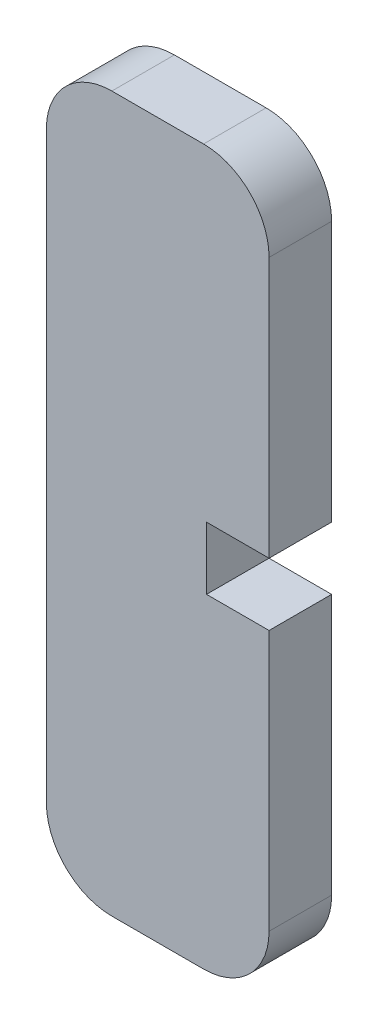
ISO-10303-21;
HEADER;
FILE_DESCRIPTION(('STEP AP214'),'2;1');
FILE_NAME('part.step','',(''),(''),'','','');
FILE_SCHEMA(('AUTOMOTIVE_DESIGN { 1 0 10303 214 1 1 1 1 }'));
ENDSEC;
DATA;
#1=APPLICATION_CONTEXT('core data for automotive mechanical design processes');
#2=APPLICATION_PROTOCOL_DEFINITION('international standard','automotive_design',2000,#1);
#3=PRODUCT_CONTEXT('',#1,'mechanical');
#4=PRODUCT('Part','Part','',(#3));
#5=PRODUCT_RELATED_PRODUCT_CATEGORY('part','',(#4));
#6=PRODUCT_DEFINITION_FORMATION('','',#4);
#7=PRODUCT_DEFINITION_CONTEXT('part definition',#1,'design');
#8=PRODUCT_DEFINITION('design','',#6,#7);
#9=PRODUCT_DEFINITION_SHAPE('','',#8);
#10=(LENGTH_UNIT() NAMED_UNIT(*) SI_UNIT(.MILLI.,.METRE.));
#11=(NAMED_UNIT(*) PLANE_ANGLE_UNIT() SI_UNIT($,.RADIAN.));
#12=(NAMED_UNIT(*) SI_UNIT($,.STERADIAN.) SOLID_ANGLE_UNIT());
#13=UNCERTAINTY_MEASURE_WITH_UNIT(LENGTH_MEASURE(1.E-05),#10,'distance_accuracy_value','');
#14=(GEOMETRIC_REPRESENTATION_CONTEXT(3) GLOBAL_UNCERTAINTY_ASSIGNED_CONTEXT((#13)) GLOBAL_UNIT_ASSIGNED_CONTEXT((#10,
#11,#12)) REPRESENTATION_CONTEXT('',''));
#15=CARTESIAN_POINT('',(0.,0.,0.));
#16=DIRECTION('',(0.,0.,1.));
#17=DIRECTION('',(1.,0.,0.));
#18=AXIS2_PLACEMENT_3D('',#15,#16,#17);
#19=CARTESIAN_POINT('',(12.4496000000003,44.7751999999999,4.7752));
#20=DIRECTION('',(-1.,0.,0.));
#21=DIRECTION('',(0.,-1.,0.));
#22=AXIS2_PLACEMENT_3D('',#19,#20,#21);
#23=PLANE('',#22);
#24=DIRECTION('',(0.,1.,0.));
#25=VECTOR('',#24,1.);
#26=CARTESIAN_POINT('',(12.4496000000003,44.7751999999999,0.));
#27=LINE('',#26,#25);
#28=CARTESIAN_POINT('',(12.4496000000001,0.224799999999933,0.));
#29=VERTEX_POINT('',#28);
#30=CARTESIAN_POINT('',(12.4496000000002,20.1123999999999,0.));
#31=VERTEX_POINT('',#30);
#32=EDGE_CURVE('E182',#29,#31,#27,.T.);
#33=ORIENTED_EDGE('',*,*,#32,.T.);
#34=DIRECTION('',(0.,0.,-1.));
#35=VECTOR('',#34,1.);
#36=CARTESIAN_POINT('',(12.4496000000002,20.1123999999999,4.7752));
#37=LINE('',#36,#35);
#38=CARTESIAN_POINT('',(12.4496000000002,20.1123999999999,4.7752));
#39=VERTEX_POINT('',#38);
#40=EDGE_CURVE('E170',#39,#31,#37,.T.);
#41=ORIENTED_EDGE('',*,*,#40,.F.);
#42=DIRECTION('',(0.,1.,0.));
#43=VECTOR('',#42,1.);
#44=CARTESIAN_POINT('',(12.4496000000003,44.7751999999999,4.7752));
#45=LINE('',#44,#43);
#46=CARTESIAN_POINT('',(12.4496000000001,0.224799999999933,4.7752));
#47=VERTEX_POINT('',#46);
#48=EDGE_CURVE('E142',#47,#39,#45,.T.);
#49=ORIENTED_EDGE('',*,*,#48,.F.);
#50=DIRECTION('',(0.,0.,-1.));
#51=VECTOR('',#50,1.);
#52=CARTESIAN_POINT('',(12.4496000000001,0.224799999999933,4.7752));
#53=LINE('',#52,#51);
#54=EDGE_CURVE('E153',#47,#29,#53,.T.);
#55=ORIENTED_EDGE('',*,*,#54,.T.);
#56=EDGE_LOOP('',(#33,#41,#49,#55));
#57=FACE_BOUND('',#56,.T.);
#58=ADVANCED_FACE('F45',(#57),#23,.F.);
#59=CARTESIAN_POINT('',(0.449600000000273,44.7751999999999,4.7752));
#60=DIRECTION('',(0.,0.,-1.));
#61=DIRECTION('',(-1.,0.,0.));
#62=AXIS2_PLACEMENT_3D('',#59,#60,#61);
#63=CYLINDRICAL_SURFACE('',#62,5.);
#64=CARTESIAN_POINT('',(0.449600000000273,44.7751999999999,0.));
#65=DIRECTION('',(0.,0.,1.));
#66=DIRECTION('',(-1.,0.,0.));
#67=AXIS2_PLACEMENT_3D('',#64,#65,#66);
#68=CIRCLE('',#67,5.);
#69=CARTESIAN_POINT('',(0.449600000000274,49.7751999999999,0.));
#70=VERTEX_POINT('',#69);
#71=CARTESIAN_POINT('',(-4.55039999999973,44.7752,0.));
#72=VERTEX_POINT('',#71);
#73=EDGE_CURVE('E165',#70,#72,#68,.T.);
#74=ORIENTED_EDGE('',*,*,#73,.T.);
#75=DIRECTION('',(0.,0.,-1.));
#76=VECTOR('',#75,1.);
#77=CARTESIAN_POINT('',(-4.55039999999973,44.7752,4.7752));
#78=LINE('',#77,#76);
#79=CARTESIAN_POINT('',(-4.55039999999973,44.7752,4.7752));
#80=VERTEX_POINT('',#79);
#81=EDGE_CURVE('E11',#80,#72,#78,.T.);
#82=ORIENTED_EDGE('',*,*,#81,.F.);
#83=CARTESIAN_POINT('',(0.449600000000273,44.7751999999999,4.7752));
#84=DIRECTION('',(0.,0.,1.));
#85=DIRECTION('',(-1.,0.,0.));
#86=AXIS2_PLACEMENT_3D('',#83,#84,#85);
#87=CIRCLE('',#86,5.);
#88=CARTESIAN_POINT('',(0.449600000000274,49.7751999999999,4.7752));
#89=VERTEX_POINT('',#88);
#90=EDGE_CURVE('E191',#89,#80,#87,.T.);
#91=ORIENTED_EDGE('',*,*,#90,.F.);
#92=DIRECTION('',(0.,0.,-1.));
#93=VECTOR('',#92,1.);
#94=CARTESIAN_POINT('',(0.449600000000274,49.7751999999999,4.7752));
#95=LINE('',#94,#93);
#96=EDGE_CURVE('E161',#89,#70,#95,.T.);
#97=ORIENTED_EDGE('',*,*,#96,.T.);
#98=EDGE_LOOP('',(#74,#82,#91,#97));
#99=FACE_BOUND('',#98,.T.);
#100=ADVANCED_FACE('F47',(#99),#63,.T.);
#101=CARTESIAN_POINT('',(-4.55039999999973,44.7752,4.7752));
#102=DIRECTION('',(1.,0.,0.));
#103=DIRECTION('',(0.,1.,0.));
#104=AXIS2_PLACEMENT_3D('',#101,#102,#103);
#105=PLANE('',#104);
#106=DIRECTION('',(0.,-1.,0.));
#107=VECTOR('',#106,1.);
#108=CARTESIAN_POINT('',(-4.55039999999973,44.7752,0.));
#109=LINE('',#108,#107);
#110=CARTESIAN_POINT('',(-4.55039999999988,0.224799999999953,0.));
#111=VERTEX_POINT('',#110);
#112=EDGE_CURVE('E169',#72,#111,#109,.T.);
#113=ORIENTED_EDGE('',*,*,#112,.T.);
#114=DIRECTION('',(0.,0.,-1.));
#115=VECTOR('',#114,1.);
#116=CARTESIAN_POINT('',(-4.55039999999988,0.224799999999953,4.7752));
#117=LINE('',#116,#115);
#118=CARTESIAN_POINT('',(-4.55039999999988,0.224799999999953,4.7752));
#119=VERTEX_POINT('',#118);
#120=EDGE_CURVE('E54',#119,#111,#117,.T.);
#121=ORIENTED_EDGE('',*,*,#120,.F.);
#122=DIRECTION('',(0.,-1.,0.));
#123=VECTOR('',#122,1.);
#124=CARTESIAN_POINT('',(-4.55039999999973,44.7752,4.7752));
#125=LINE('',#124,#123);
#126=EDGE_CURVE('E111',#80,#119,#125,.T.);
#127=ORIENTED_EDGE('',*,*,#126,.F.);
#128=ORIENTED_EDGE('',*,*,#81,.T.);
#129=EDGE_LOOP('',(#113,#121,#127,#128));
#130=FACE_BOUND('',#129,.T.);
#131=ADVANCED_FACE('F297',(#130),#105,.F.);
#132=CARTESIAN_POINT('',(0.449600000000116,0.224799999999933,4.7752));
#133=DIRECTION('',(0.,0.,-1.));
#134=DIRECTION('',(-1.,0.,0.));
#135=AXIS2_PLACEMENT_3D('',#132,#133,#134);
#136=CYLINDRICAL_SURFACE('',#135,5.);
#137=CARTESIAN_POINT('',(0.449600000000116,0.224799999999933,0.));
#138=DIRECTION('',(0.,0.,1.));
#139=DIRECTION('',(1.,0.,0.));
#140=AXIS2_PLACEMENT_3D('',#137,#138,#139);
#141=CIRCLE('',#140,5.);
#142=CARTESIAN_POINT('',(0.449600000000115,-4.77520000000007,0.));
#143=VERTEX_POINT('',#142);
#144=EDGE_CURVE('E173',#111,#143,#141,.T.);
#145=ORIENTED_EDGE('',*,*,#144,.T.);
#146=DIRECTION('',(0.,0.,-1.));
#147=VECTOR('',#146,1.);
#148=CARTESIAN_POINT('',(0.449600000000115,-4.77520000000007,4.7752));
#149=LINE('',#148,#147);
#150=CARTESIAN_POINT('',(0.449600000000115,-4.77520000000007,4.7752));
#151=VERTEX_POINT('',#150);
#152=EDGE_CURVE('E203',#151,#143,#149,.T.);
#153=ORIENTED_EDGE('',*,*,#152,.F.);
#154=CARTESIAN_POINT('',(0.449600000000116,0.224799999999933,4.7752));
#155=DIRECTION('',(0.,0.,1.));
#156=DIRECTION('',(1.,0.,0.));
#157=AXIS2_PLACEMENT_3D('',#154,#155,#156);
#158=CIRCLE('',#157,5.);
#159=EDGE_CURVE('E213',#119,#151,#158,.T.);
#160=ORIENTED_EDGE('',*,*,#159,.F.);
#161=ORIENTED_EDGE('',*,*,#120,.T.);
#162=EDGE_LOOP('',(#145,#153,#160,#161));
#163=FACE_BOUND('',#162,.T.);
#164=ADVANCED_FACE('F211',(#163),#136,.T.);
#165=CARTESIAN_POINT('',(0.449600000000116,-4.77520000000007,4.7752));
#166=DIRECTION('',(0.,1.,0.));
#167=DIRECTION('',(0.,0.,1.));
#168=AXIS2_PLACEMENT_3D('',#165,#166,#167);
#169=PLANE('',#168);
#170=DIRECTION('',(1.,0.,0.));
#171=VECTOR('',#170,1.);
#172=CARTESIAN_POINT('',(0.449600000000116,-4.77520000000007,0.));
#173=LINE('',#172,#171);
#174=CARTESIAN_POINT('',(7.44960000000012,-4.77520000000007,0.));
#175=VERTEX_POINT('',#174);
#176=EDGE_CURVE('E176',#143,#175,#173,.T.);
#177=ORIENTED_EDGE('',*,*,#176,.T.);
#178=DIRECTION('',(0.,0.,-1.));
#179=VECTOR('',#178,1.);
#180=CARTESIAN_POINT('',(7.44960000000012,-4.77520000000007,4.7752));
#181=LINE('',#180,#179);
#182=CARTESIAN_POINT('',(7.44960000000012,-4.77520000000007,4.7752));
#183=VERTEX_POINT('',#182);
#184=EDGE_CURVE('E199',#183,#175,#181,.T.);
#185=ORIENTED_EDGE('',*,*,#184,.F.);
#186=DIRECTION('',(1.,0.,0.));
#187=VECTOR('',#186,1.);
#188=CARTESIAN_POINT('',(0.449600000000116,-4.77520000000007,4.7752));
#189=LINE('',#188,#187);
#190=EDGE_CURVE('E230',#151,#183,#189,.T.);
#191=ORIENTED_EDGE('',*,*,#190,.F.);
#192=ORIENTED_EDGE('',*,*,#152,.T.);
#193=EDGE_LOOP('',(#177,#185,#191,#192));
#194=FACE_BOUND('',#193,.T.);
#195=ADVANCED_FACE('F222',(#194),#169,.F.);
#196=CARTESIAN_POINT('',(7.44960000000012,0.224799999999933,4.7752));
#197=DIRECTION('',(0.,0.,-1.));
#198=DIRECTION('',(-1.,0.,0.));
#199=AXIS2_PLACEMENT_3D('',#196,#197,#198);
#200=CYLINDRICAL_SURFACE('',#199,5.);
#201=CARTESIAN_POINT('',(7.44960000000012,0.224799999999933,0.));
#202=DIRECTION('',(0.,0.,1.));
#203=DIRECTION('',(1.,0.,0.));
#204=AXIS2_PLACEMENT_3D('',#201,#202,#203);
#205=CIRCLE('',#204,5.);
#206=EDGE_CURVE('E179',#175,#29,#205,.T.);
#207=ORIENTED_EDGE('',*,*,#206,.T.);
#208=ORIENTED_EDGE('',*,*,#54,.F.);
#209=CARTESIAN_POINT('',(7.44960000000012,0.224799999999933,4.7752));
#210=DIRECTION('',(0.,0.,1.));
#211=DIRECTION('',(1.,0.,0.));
#212=AXIS2_PLACEMENT_3D('',#209,#210,#211);
#213=CIRCLE('',#212,5.);
#214=EDGE_CURVE('E143',#183,#47,#213,.T.);
#215=ORIENTED_EDGE('',*,*,#214,.F.);
#216=ORIENTED_EDGE('',*,*,#184,.T.);
#217=EDGE_LOOP('',(#207,#208,#215,#216));
#218=FACE_BOUND('',#217,.T.);
#219=ADVANCED_FACE('F226',(#218),#200,.T.);
#220=CARTESIAN_POINT('',(12.4496000000002,24.8875999999999,4.7752));
#221=VERTEX_POINT('',#220);
#222=CARTESIAN_POINT('',(12.4496000000003,44.7751999999999,4.7752));
#223=VERTEX_POINT('',#222);
#224=EDGE_CURVE('E128',#221,#223,#45,.T.);
#225=ORIENTED_EDGE('',*,*,#224,.F.);
#226=DIRECTION('',(0.,0.,-1.));
#227=VECTOR('',#226,1.);
#228=CARTESIAN_POINT('',(12.4496000000002,24.8875999999999,4.7752));
#229=LINE('',#228,#227);
#230=CARTESIAN_POINT('',(12.4496000000002,24.8875999999999,0.));
#231=VERTEX_POINT('',#230);
#232=EDGE_CURVE('E247',#221,#231,#229,.T.);
#233=ORIENTED_EDGE('',*,*,#232,.T.);
#234=CARTESIAN_POINT('',(12.4496000000003,44.7751999999999,0.));
#235=VERTEX_POINT('',#234);
#236=EDGE_CURVE('E149',#231,#235,#27,.T.);
#237=ORIENTED_EDGE('',*,*,#236,.T.);
#238=DIRECTION('',(0.,0.,-1.));
#239=VECTOR('',#238,1.);
#240=CARTESIAN_POINT('',(12.4496000000003,44.7751999999999,4.7752));
#241=LINE('',#240,#239);
#242=EDGE_CURVE('E146',#223,#235,#241,.T.);
#243=ORIENTED_EDGE('',*,*,#242,.F.);
#244=EDGE_LOOP('',(#225,#233,#237,#243));
#245=FACE_BOUND('',#244,.T.);
#246=ADVANCED_FACE('F147',(#245),#23,.F.);
#247=CARTESIAN_POINT('',(7.44960000000027,44.7751999999999,4.7752));
#248=DIRECTION('',(0.,0.,-1.));
#249=DIRECTION('',(-1.,0.,0.));
#250=AXIS2_PLACEMENT_3D('',#247,#248,#249);
#251=CYLINDRICAL_SURFACE('',#250,5.);
#252=CARTESIAN_POINT('',(7.44960000000027,44.7751999999999,0.));
#253=DIRECTION('',(0.,0.,1.));
#254=DIRECTION('',(-1.,0.,0.));
#255=AXIS2_PLACEMENT_3D('',#252,#253,#254);
#256=CIRCLE('',#255,5.);
#257=CARTESIAN_POINT('',(7.44960000000028,49.7751999999999,0.));
#258=VERTEX_POINT('',#257);
#259=EDGE_CURVE('E186',#235,#258,#256,.T.);
#260=ORIENTED_EDGE('',*,*,#259,.T.);
#261=DIRECTION('',(0.,0.,-1.));
#262=VECTOR('',#261,1.);
#263=CARTESIAN_POINT('',(7.44960000000028,49.7751999999999,4.7752));
#264=LINE('',#263,#262);
#265=CARTESIAN_POINT('',(7.44960000000028,49.7751999999999,4.7752));
#266=VERTEX_POINT('',#265);
#267=EDGE_CURVE('E154',#266,#258,#264,.T.);
#268=ORIENTED_EDGE('',*,*,#267,.F.);
#269=CARTESIAN_POINT('',(7.44960000000027,44.7751999999999,4.7752));
#270=DIRECTION('',(0.,0.,1.));
#271=DIRECTION('',(-1.,0.,0.));
#272=AXIS2_PLACEMENT_3D('',#269,#270,#271);
#273=CIRCLE('',#272,5.);
#274=EDGE_CURVE('E133',#223,#266,#273,.T.);
#275=ORIENTED_EDGE('',*,*,#274,.F.);
#276=ORIENTED_EDGE('',*,*,#242,.T.);
#277=EDGE_LOOP('',(#260,#268,#275,#276));
#278=FACE_BOUND('',#277,.T.);
#279=ADVANCED_FACE('F156',(#278),#251,.T.);
#280=CARTESIAN_POINT('',(0.449600000000274,49.7751999999999,4.7752));
#281=DIRECTION('',(0.,-1.,0.));
#282=DIRECTION('',(0.,0.,-1.));
#283=AXIS2_PLACEMENT_3D('',#280,#281,#282);
#284=PLANE('',#283);
#285=DIRECTION('',(-1.,0.,0.));
#286=VECTOR('',#285,1.);
#287=CARTESIAN_POINT('',(0.449600000000274,49.7751999999999,0.));
#288=LINE('',#287,#286);
#289=EDGE_CURVE('E103',#258,#70,#288,.T.);
#290=ORIENTED_EDGE('',*,*,#289,.T.);
#291=ORIENTED_EDGE('',*,*,#96,.F.);
#292=DIRECTION('',(-1.,0.,0.));
#293=VECTOR('',#292,1.);
#294=CARTESIAN_POINT('',(0.449600000000274,49.7751999999999,4.7752));
#295=LINE('',#294,#293);
#296=EDGE_CURVE('E70',#266,#89,#295,.T.);
#297=ORIENTED_EDGE('',*,*,#296,.F.);
#298=ORIENTED_EDGE('',*,*,#267,.T.);
#299=EDGE_LOOP('',(#290,#291,#297,#298));
#300=FACE_BOUND('',#299,.T.);
#301=ADVANCED_FACE('F293',(#300),#284,.F.);
#302=CARTESIAN_POINT('',(0.449600000000273,44.7751999999999,4.7752));
#303=DIRECTION('',(0.,0.,-1.));
#304=DIRECTION('',(-1.,0.,0.));
#305=AXIS2_PLACEMENT_3D('',#302,#303,#304);
#306=PLANE('',#305);
#307=ORIENTED_EDGE('',*,*,#48,.T.);
#308=DIRECTION('',(-1.,0.,0.));
#309=VECTOR('',#308,1.);
#310=CARTESIAN_POINT('',(7.67440000000012,20.1123999999999,4.7752));
#311=LINE('',#310,#309);
#312=CARTESIAN_POINT('',(7.67440000000012,20.1123999999999,4.7752));
#313=VERTEX_POINT('',#312);
#314=EDGE_CURVE('E256',#39,#313,#311,.T.);
#315=ORIENTED_EDGE('',*,*,#314,.T.);
#316=DIRECTION('',(0.,1.,0.));
#317=VECTOR('',#316,1.);
#318=CARTESIAN_POINT('',(7.67440000000012,20.1123999999999,4.7752));
#319=LINE('',#318,#317);
#320=CARTESIAN_POINT('',(7.67440000000012,24.8875999999999,4.7752));
#321=VERTEX_POINT('',#320);
#322=EDGE_CURVE('E265',#313,#321,#319,.T.);
#323=ORIENTED_EDGE('',*,*,#322,.T.);
#324=DIRECTION('',(1.,0.,0.));
#325=VECTOR('',#324,1.);
#326=CARTESIAN_POINT('',(7.67440000000012,24.8875999999999,4.7752));
#327=LINE('',#326,#325);
#328=EDGE_CURVE('E138',#321,#221,#327,.T.);
#329=ORIENTED_EDGE('',*,*,#328,.T.);
#330=ORIENTED_EDGE('',*,*,#224,.T.);
#331=ORIENTED_EDGE('',*,*,#274,.T.);
#332=ORIENTED_EDGE('',*,*,#296,.T.);
#333=ORIENTED_EDGE('',*,*,#90,.T.);
#334=ORIENTED_EDGE('',*,*,#126,.T.);
#335=ORIENTED_EDGE('',*,*,#159,.T.);
#336=ORIENTED_EDGE('',*,*,#190,.T.);
#337=ORIENTED_EDGE('',*,*,#214,.T.);
#338=EDGE_LOOP('',(#307,#315,#323,#329,#330,#331,#332,#333,#334,#335,#336,#337));
#339=FACE_BOUND('',#338,.T.);
#340=ADVANCED_FACE('F131',(#339),#306,.F.);
#341=CARTESIAN_POINT('',(0.449600000000273,44.7751999999999,0.));
#342=DIRECTION('',(0.,0.,-1.));
#343=DIRECTION('',(-1.,0.,0.));
#344=AXIS2_PLACEMENT_3D('',#341,#342,#343);
#345=PLANE('',#344);
#346=DIRECTION('',(-1.,0.,0.));
#347=VECTOR('',#346,1.);
#348=CARTESIAN_POINT('',(7.67440000000012,20.1123999999999,0.));
#349=LINE('',#348,#347);
#350=CARTESIAN_POINT('',(7.67440000000012,20.1123999999999,0.));
#351=VERTEX_POINT('',#350);
#352=EDGE_CURVE('E61',#31,#351,#349,.T.);
#353=ORIENTED_EDGE('',*,*,#352,.F.);
#354=ORIENTED_EDGE('',*,*,#32,.F.);
#355=ORIENTED_EDGE('',*,*,#206,.F.);
#356=ORIENTED_EDGE('',*,*,#176,.F.);
#357=ORIENTED_EDGE('',*,*,#144,.F.);
#358=ORIENTED_EDGE('',*,*,#112,.F.);
#359=ORIENTED_EDGE('',*,*,#73,.F.);
#360=ORIENTED_EDGE('',*,*,#289,.F.);
#361=ORIENTED_EDGE('',*,*,#259,.F.);
#362=ORIENTED_EDGE('',*,*,#236,.F.);
#363=DIRECTION('',(1.,0.,0.));
#364=VECTOR('',#363,1.);
#365=CARTESIAN_POINT('',(7.67440000000012,24.8875999999999,0.));
#366=LINE('',#365,#364);
#367=CARTESIAN_POINT('',(7.67440000000012,24.8875999999999,0.));
#368=VERTEX_POINT('',#367);
#369=EDGE_CURVE('E252',#368,#231,#366,.T.);
#370=ORIENTED_EDGE('',*,*,#369,.F.);
#371=DIRECTION('',(0.,1.,0.));
#372=VECTOR('',#371,1.);
#373=CARTESIAN_POINT('',(7.67440000000012,20.1123999999999,0.));
#374=LINE('',#373,#372);
#375=EDGE_CURVE('E257',#351,#368,#374,.T.);
#376=ORIENTED_EDGE('',*,*,#375,.F.);
#377=EDGE_LOOP('',(#353,#354,#355,#356,#357,#358,#359,#360,#361,#362,#370,#376));
#378=FACE_BOUND('',#377,.T.);
#379=ADVANCED_FACE('F216',(#378),#345,.T.);
#380=CARTESIAN_POINT('',(7.67440000000012,20.1123999999999,4.7752));
#381=DIRECTION('',(0.,-1.,0.));
#382=DIRECTION('',(1.,0.,0.));
#383=AXIS2_PLACEMENT_3D('',#380,#381,#382);
#384=PLANE('',#383);
#385=ORIENTED_EDGE('',*,*,#352,.T.);
#386=DIRECTION('',(0.,0.,-1.));
#387=VECTOR('',#386,1.);
#388=CARTESIAN_POINT('',(7.67440000000012,20.1123999999999,4.7752));
#389=LINE('',#388,#387);
#390=EDGE_CURVE('E240',#313,#351,#389,.T.);
#391=ORIENTED_EDGE('',*,*,#390,.F.);
#392=ORIENTED_EDGE('',*,*,#314,.F.);
#393=ORIENTED_EDGE('',*,*,#40,.T.);
#394=EDGE_LOOP('',(#385,#391,#392,#393));
#395=FACE_BOUND('',#394,.T.);
#396=ADVANCED_FACE('F276',(#395),#384,.F.);
#397=CARTESIAN_POINT('',(7.67440000000012,24.8875999999999,4.7752));
#398=DIRECTION('',(0.,1.,0.));
#399=DIRECTION('',(-1.,0.,0.));
#400=AXIS2_PLACEMENT_3D('',#397,#398,#399);
#401=PLANE('',#400);
#402=ORIENTED_EDGE('',*,*,#369,.T.);
#403=ORIENTED_EDGE('',*,*,#232,.F.);
#404=ORIENTED_EDGE('',*,*,#328,.F.);
#405=DIRECTION('',(0.,0.,-1.));
#406=VECTOR('',#405,1.);
#407=CARTESIAN_POINT('',(7.67440000000012,24.8875999999999,4.7752));
#408=LINE('',#407,#406);
#409=EDGE_CURVE('E243',#321,#368,#408,.T.);
#410=ORIENTED_EDGE('',*,*,#409,.T.);
#411=EDGE_LOOP('',(#402,#403,#404,#410));
#412=FACE_BOUND('',#411,.T.);
#413=ADVANCED_FACE('F291',(#412),#401,.F.);
#414=CARTESIAN_POINT('',(7.67440000000012,20.1123999999999,4.7752));
#415=DIRECTION('',(-1.,0.,0.));
#416=DIRECTION('',(0.,0.,1.));
#417=AXIS2_PLACEMENT_3D('',#414,#415,#416);
#418=PLANE('',#417);
#419=ORIENTED_EDGE('',*,*,#375,.T.);
#420=ORIENTED_EDGE('',*,*,#409,.F.);
#421=ORIENTED_EDGE('',*,*,#322,.F.);
#422=ORIENTED_EDGE('',*,*,#390,.T.);
#423=EDGE_LOOP('',(#419,#420,#421,#422));
#424=FACE_BOUND('',#423,.T.);
#425=ADVANCED_FACE('F285',(#424),#418,.F.);
#426=CLOSED_SHELL('',(#58,#100,#131,#164,#195,#219,#246,#279,#301,#340,#379,#396,#413,#425));
#427=MANIFOLD_SOLID_BREP('B2',#426);
#428=ADVANCED_BREP_SHAPE_REPRESENTATION('',(#18,#427),#14);
#429=SHAPE_DEFINITION_REPRESENTATION(#9,#428);
ENDSEC;
END-ISO-10303-21;
